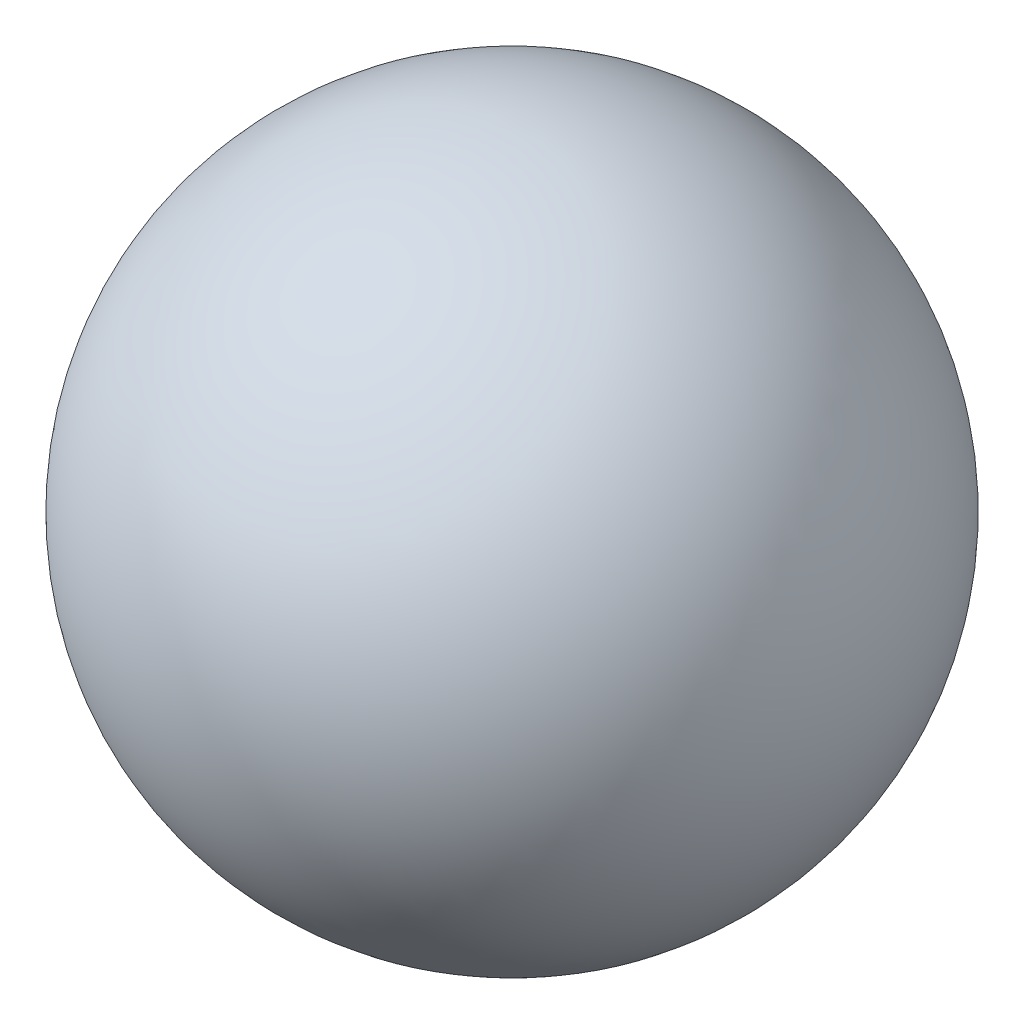
ISO-10303-21;
HEADER;
FILE_DESCRIPTION(('STEP AP214'),'2;1');
FILE_NAME('part.step','',(''),(''),'','','');
FILE_SCHEMA(('AUTOMOTIVE_DESIGN { 1 0 10303 214 1 1 1 1 }'));
ENDSEC;
DATA;
#1=APPLICATION_CONTEXT('core data for automotive mechanical design processes');
#2=APPLICATION_PROTOCOL_DEFINITION('international standard','automotive_design',2000,#1);
#3=PRODUCT_CONTEXT('',#1,'mechanical');
#4=PRODUCT('Part','Part','',(#3));
#5=PRODUCT_RELATED_PRODUCT_CATEGORY('part','',(#4));
#6=PRODUCT_DEFINITION_FORMATION('','',#4);
#7=PRODUCT_DEFINITION_CONTEXT('part definition',#1,'design');
#8=PRODUCT_DEFINITION('design','',#6,#7);
#9=PRODUCT_DEFINITION_SHAPE('','',#8);
#10=(LENGTH_UNIT() NAMED_UNIT(*) SI_UNIT(.MILLI.,.METRE.));
#11=(NAMED_UNIT(*) PLANE_ANGLE_UNIT() SI_UNIT($,.RADIAN.));
#12=(NAMED_UNIT(*) SI_UNIT($,.STERADIAN.) SOLID_ANGLE_UNIT());
#13=UNCERTAINTY_MEASURE_WITH_UNIT(LENGTH_MEASURE(1.E-05),#10,'distance_accuracy_value','');
#14=(GEOMETRIC_REPRESENTATION_CONTEXT(3) GLOBAL_UNCERTAINTY_ASSIGNED_CONTEXT((#13)) GLOBAL_UNIT_ASSIGNED_CONTEXT((#10,
#11,#12)) REPRESENTATION_CONTEXT('',''));
#15=CARTESIAN_POINT('',(0.,0.,0.));
#16=DIRECTION('',(0.,0.,1.));
#17=DIRECTION('',(1.,0.,0.));
#18=AXIS2_PLACEMENT_3D('',#15,#16,#17);
#19=CARTESIAN_POINT('',(0.,0.,0.));
#20=DIRECTION('',(0.,1.,0.));
#21=DIRECTION('',(1.,0.,0.));
#22=AXIS2_PLACEMENT_3D('',#19,#20,#21);
#23=SPHERICAL_SURFACE('',#22,30.);
#24=CARTESIAN_POINT('',(0.,30.,0.));
#25=VERTEX_POINT('',#24);
#26=VERTEX_LOOP('',#25);
#27=FACE_BOUND('',#26,.T.);
#28=ADVANCED_FACE('F28',(#27),#23,.T.);
#29=CLOSED_SHELL('',(#28));
#30=MANIFOLD_SOLID_BREP('B2',#29);
#31=ADVANCED_BREP_SHAPE_REPRESENTATION('',(#18,#30),#14);
#32=SHAPE_DEFINITION_REPRESENTATION(#9,#31);
ENDSEC;
END-ISO-10303-21;
